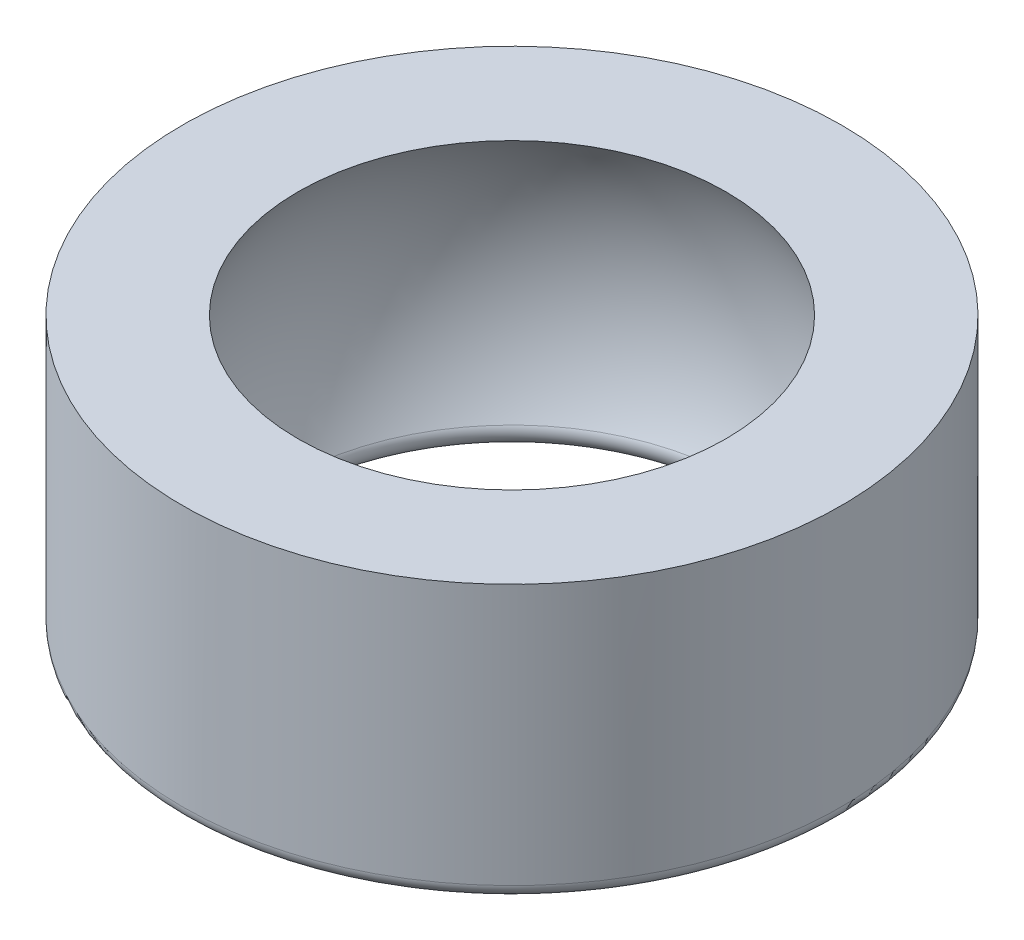
ISO-10303-21;
HEADER;
FILE_DESCRIPTION(('STEP AP214'),'2;1');
FILE_NAME('part.step','',(''),(''),'','','');
FILE_SCHEMA(('AUTOMOTIVE_DESIGN { 1 0 10303 214 1 1 1 1 }'));
ENDSEC;
DATA;
#1=APPLICATION_CONTEXT('core data for automotive mechanical design processes');
#2=APPLICATION_PROTOCOL_DEFINITION('international standard','automotive_design',2000,#1);
#3=PRODUCT_CONTEXT('',#1,'mechanical');
#4=PRODUCT('Part','Part','',(#3));
#5=PRODUCT_RELATED_PRODUCT_CATEGORY('part','',(#4));
#6=PRODUCT_DEFINITION_FORMATION('','',#4);
#7=PRODUCT_DEFINITION_CONTEXT('part definition',#1,'design');
#8=PRODUCT_DEFINITION('design','',#6,#7);
#9=PRODUCT_DEFINITION_SHAPE('','',#8);
#10=(LENGTH_UNIT() NAMED_UNIT(*) SI_UNIT(.MILLI.,.METRE.));
#11=(NAMED_UNIT(*) PLANE_ANGLE_UNIT() SI_UNIT($,.RADIAN.));
#12=(NAMED_UNIT(*) SI_UNIT($,.STERADIAN.) SOLID_ANGLE_UNIT());
#13=UNCERTAINTY_MEASURE_WITH_UNIT(LENGTH_MEASURE(1.E-05),#10,'distance_accuracy_value','');
#14=(GEOMETRIC_REPRESENTATION_CONTEXT(3) GLOBAL_UNCERTAINTY_ASSIGNED_CONTEXT((#13)) GLOBAL_UNIT_ASSIGNED_CONTEXT((#10,
#11,#12)) REPRESENTATION_CONTEXT('',''));
#15=CARTESIAN_POINT('',(0.,0.,0.));
#16=DIRECTION('',(0.,0.,1.));
#17=DIRECTION('',(1.,0.,0.));
#18=AXIS2_PLACEMENT_3D('',#15,#16,#17);
#19=CARTESIAN_POINT('',(0.,0.,0.));
#20=DIRECTION('',(0.,-1.,0.));
#21=DIRECTION('',(-1.,0.,0.));
#22=AXIS2_PLACEMENT_3D('',#19,#20,#21);
#23=SPHERICAL_SURFACE('',#22,5.555);
#24=CARTESIAN_POINT('',(0.,-2.56165670367208,0.));
#25=DIRECTION('',(0.,1.,0.));
#26=DIRECTION('',(0.,0.,1.));
#27=AXIS2_PLACEMENT_3D('',#24,#25,#26);
#28=CIRCLE('',#27,4.92909118728107);
#29=CARTESIAN_POINT('',(0.,-2.56165670367208,4.92909118728107));
#30=VERTEX_POINT('',#29);
#31=EDGE_CURVE('E54',#30,#30,#28,.F.);
#32=ORIENTED_EDGE('',*,*,#31,.T.);
#33=EDGE_LOOP('',(#32));
#34=FACE_BOUND('',#33,.T.);
#35=CARTESIAN_POINT('',(0.,3.,0.));
#36=DIRECTION('',(0.,-1.,0.));
#37=DIRECTION('',(0.,0.,-1.));
#38=AXIS2_PLACEMENT_3D('',#35,#36,#37);
#39=CIRCLE('',#38,4.67525667744564);
#40=CARTESIAN_POINT('',(0.,3.,-4.67525667744564));
#41=VERTEX_POINT('',#40);
#42=EDGE_CURVE('E60',#41,#41,#39,.T.);
#43=ORIENTED_EDGE('',*,*,#42,.F.);
#44=EDGE_LOOP('',(#43));
#45=FACE_BOUND('',#44,.T.);
#46=ADVANCED_FACE('F36',(#34,#45),#23,.F.);
#47=CARTESIAN_POINT('',(-4.67525667744564,3.,0.));
#48=DIRECTION('',(0.,-1.,0.));
#49=DIRECTION('',(0.,0.,-1.));
#50=AXIS2_PLACEMENT_3D('',#47,#48,#49);
#51=PLANE('',#50);
#52=CARTESIAN_POINT('',(0.,3.,0.));
#53=DIRECTION('',(0.,-1.,0.));
#54=DIRECTION('',(0.,0.,-1.));
#55=AXIS2_PLACEMENT_3D('',#52,#53,#54);
#56=CIRCLE('',#55,7.2);
#57=CARTESIAN_POINT('',(0.,3.,-7.2));
#58=VERTEX_POINT('',#57);
#59=EDGE_CURVE('E64',#58,#58,#56,.T.);
#60=ORIENTED_EDGE('',*,*,#59,.F.);
#61=EDGE_LOOP('',(#60));
#62=FACE_BOUND('',#61,.T.);
#63=ORIENTED_EDGE('',*,*,#42,.T.);
#64=EDGE_LOOP('',(#63));
#65=FACE_BOUND('',#64,.T.);
#66=ADVANCED_FACE('F71',(#62,#65),#51,.F.);
#67=CARTESIAN_POINT('',(0.,-3.80976820188496,0.));
#68=DIRECTION('',(0.,-1.,0.));
#69=DIRECTION('',(0.,0.,-1.));
#70=AXIS2_PLACEMENT_3D('',#67,#68,#69);
#71=CYLINDRICAL_SURFACE('',#70,7.2);
#72=CARTESIAN_POINT('',(0.,-2.7,0.));
#73=DIRECTION('',(0.,1.,0.));
#74=DIRECTION('',(0.,0.,1.));
#75=AXIS2_PLACEMENT_3D('',#72,#73,#74);
#76=CIRCLE('',#75,7.2);
#77=CARTESIAN_POINT('',(0.,-2.7,7.2));
#78=VERTEX_POINT('',#77);
#79=EDGE_CURVE('E10',#78,#78,#76,.T.);
#80=ORIENTED_EDGE('',*,*,#79,.T.);
#81=EDGE_LOOP('',(#80));
#82=FACE_BOUND('',#81,.T.);
#83=ORIENTED_EDGE('',*,*,#59,.T.);
#84=EDGE_LOOP('',(#83));
#85=FACE_BOUND('',#84,.T.);
#86=ADVANCED_FACE('F69',(#82,#85),#71,.T.);
#87=CARTESIAN_POINT('',(-7.2,-3.,0.));
#88=DIRECTION('',(0.,1.,0.));
#89=DIRECTION('',(0.,0.,1.));
#90=AXIS2_PLACEMENT_3D('',#87,#88,#89);
#91=PLANE('',#90);
#92=CARTESIAN_POINT('',(0.,-3.,0.));
#93=DIRECTION('',(0.,1.,0.));
#94=DIRECTION('',(0.,0.,1.));
#95=AXIS2_PLACEMENT_3D('',#92,#93,#94);
#96=CIRCLE('',#95,6.9);
#97=CARTESIAN_POINT('',(0.,-3.,6.9));
#98=VERTEX_POINT('',#97);
#99=EDGE_CURVE('E44',#98,#98,#96,.F.);
#100=ORIENTED_EDGE('',*,*,#99,.T.);
#101=EDGE_LOOP('',(#100));
#102=FACE_BOUND('',#101,.T.);
#103=CARTESIAN_POINT('',(0.,-3.,0.));
#104=DIRECTION('',(0.,1.,0.));
#105=DIRECTION('',(0.,0.,1.));
#106=AXIS2_PLACEMENT_3D('',#103,#104,#105);
#107=CIRCLE('',#106,5.19528873114864);
#108=CARTESIAN_POINT('',(0.,-3.,5.19528873114864));
#109=VERTEX_POINT('',#108);
#110=EDGE_CURVE('E49',#109,#109,#107,.T.);
#111=ORIENTED_EDGE('',*,*,#110,.T.);
#112=EDGE_LOOP('',(#111));
#113=FACE_BOUND('',#112,.T.);
#114=ADVANCED_FACE('F85',(#102,#113),#91,.F.);
#115=CARTESIAN_POINT('',(0.,-2.7,0.));
#116=DIRECTION('',(0.,1.,0.));
#117=DIRECTION('',(0.,0.,1.));
#118=AXIS2_PLACEMENT_3D('',#115,#116,#117);
#119=TOROIDAL_SURFACE('',#118,5.19528873114864,0.3);
#120=ORIENTED_EDGE('',*,*,#110,.F.);
#121=EDGE_LOOP('',(#120));
#122=FACE_BOUND('',#121,.T.);
#123=ORIENTED_EDGE('',*,*,#31,.F.);
#124=EDGE_LOOP('',(#123));
#125=FACE_BOUND('',#124,.T.);
#126=ADVANCED_FACE('F83',(#122,#125),#119,.T.);
#127=CARTESIAN_POINT('',(0.,-2.7,0.));
#128=DIRECTION('',(0.,1.,0.));
#129=DIRECTION('',(0.,0.,1.));
#130=AXIS2_PLACEMENT_3D('',#127,#128,#129);
#131=TOROIDAL_SURFACE('',#130,6.9,0.3);
#132=ORIENTED_EDGE('',*,*,#79,.F.);
#133=EDGE_LOOP('',(#132));
#134=FACE_BOUND('',#133,.T.);
#135=ORIENTED_EDGE('',*,*,#99,.F.);
#136=EDGE_LOOP('',(#135));
#137=FACE_BOUND('',#136,.T.);
#138=ADVANCED_FACE('F38',(#134,#137),#131,.T.);
#139=CLOSED_SHELL('',(#46,#66,#86,#114,#126,#138));
#140=MANIFOLD_SOLID_BREP('B2',#139);
#141=ADVANCED_BREP_SHAPE_REPRESENTATION('',(#18,#140),#14);
#142=SHAPE_DEFINITION_REPRESENTATION(#9,#141);
ENDSEC;
END-ISO-10303-21;
